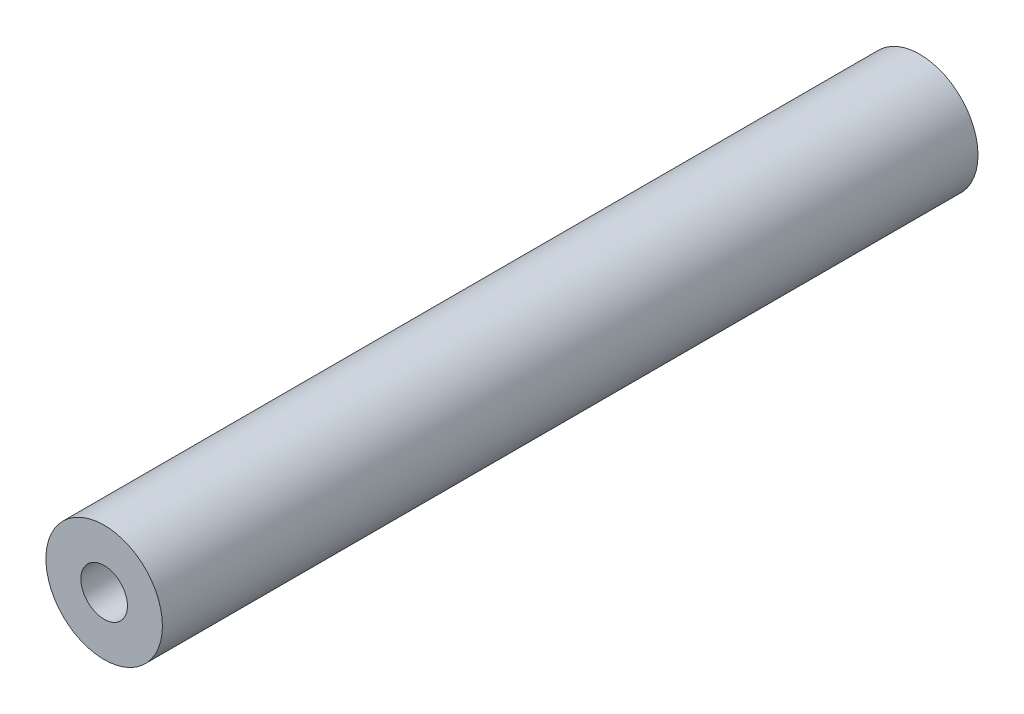
ISO-10303-21;
HEADER;
FILE_DESCRIPTION(('STEP AP214'),'2;1');
FILE_NAME('part.step','',(''),(''),'','','');
FILE_SCHEMA(('AUTOMOTIVE_DESIGN { 1 0 10303 214 1 1 1 1 }'));
ENDSEC;
DATA;
#1=APPLICATION_CONTEXT('core data for automotive mechanical design processes');
#2=APPLICATION_PROTOCOL_DEFINITION('international standard','automotive_design',2000,#1);
#3=PRODUCT_CONTEXT('',#1,'mechanical');
#4=PRODUCT('Part','Part','',(#3));
#5=PRODUCT_RELATED_PRODUCT_CATEGORY('part','',(#4));
#6=PRODUCT_DEFINITION_FORMATION('','',#4);
#7=PRODUCT_DEFINITION_CONTEXT('part definition',#1,'design');
#8=PRODUCT_DEFINITION('design','',#6,#7);
#9=PRODUCT_DEFINITION_SHAPE('','',#8);
#10=(LENGTH_UNIT() NAMED_UNIT(*) SI_UNIT(.MILLI.,.METRE.));
#11=(NAMED_UNIT(*) PLANE_ANGLE_UNIT() SI_UNIT($,.RADIAN.));
#12=(NAMED_UNIT(*) SI_UNIT($,.STERADIAN.) SOLID_ANGLE_UNIT());
#13=UNCERTAINTY_MEASURE_WITH_UNIT(LENGTH_MEASURE(1.E-05),#10,'distance_accuracy_value','');
#14=(GEOMETRIC_REPRESENTATION_CONTEXT(3) GLOBAL_UNCERTAINTY_ASSIGNED_CONTEXT((#13)) GLOBAL_UNIT_ASSIGNED_CONTEXT((#10,
#11,#12)) REPRESENTATION_CONTEXT('',''));
#15=CARTESIAN_POINT('',(0.,0.,0.));
#16=DIRECTION('',(0.,0.,1.));
#17=DIRECTION('',(1.,0.,0.));
#18=AXIS2_PLACEMENT_3D('',#15,#16,#17);
#19=CARTESIAN_POINT('',(0.,0.,70.));
#20=DIRECTION('',(0.,0.,1.));
#21=DIRECTION('',(1.,0.,0.));
#22=AXIS2_PLACEMENT_3D('',#19,#20,#21);
#23=PLANE('',#22);
#24=CARTESIAN_POINT('',(0.,0.,70.));
#25=DIRECTION('',(0.,0.,1.));
#26=DIRECTION('',(1.,0.,0.));
#27=AXIS2_PLACEMENT_3D('',#24,#25,#26);
#28=CIRCLE('',#27,5.);
#29=CARTESIAN_POINT('',(5.,0.,70.));
#30=VERTEX_POINT('',#29);
#31=EDGE_CURVE('E10',#30,#30,#28,.T.);
#32=ORIENTED_EDGE('',*,*,#31,.T.);
#33=EDGE_LOOP('',(#32));
#34=FACE_BOUND('',#33,.T.);
#35=CARTESIAN_POINT('',(0.,0.,70.));
#36=DIRECTION('',(0.,0.,1.));
#37=DIRECTION('',(1.,0.,0.));
#38=AXIS2_PLACEMENT_3D('',#35,#36,#37);
#39=CIRCLE('',#38,2.);
#40=CARTESIAN_POINT('',(2.,0.,70.));
#41=VERTEX_POINT('',#40);
#42=EDGE_CURVE('E41',#41,#41,#39,.T.);
#43=ORIENTED_EDGE('',*,*,#42,.F.);
#44=EDGE_LOOP('',(#43));
#45=FACE_BOUND('',#44,.T.);
#46=ADVANCED_FACE('F30',(#34,#45),#23,.T.);
#47=CARTESIAN_POINT('',(0.,0.,0.));
#48=DIRECTION('',(0.,0.,1.));
#49=DIRECTION('',(1.,0.,0.));
#50=AXIS2_PLACEMENT_3D('',#47,#48,#49);
#51=PLANE('',#50);
#52=CARTESIAN_POINT('',(0.,0.,0.));
#53=DIRECTION('',(0.,0.,1.));
#54=DIRECTION('',(1.,0.,0.));
#55=AXIS2_PLACEMENT_3D('',#52,#53,#54);
#56=CIRCLE('',#55,5.);
#57=CARTESIAN_POINT('',(5.,0.,0.));
#58=VERTEX_POINT('',#57);
#59=EDGE_CURVE('E34',#58,#58,#56,.T.);
#60=ORIENTED_EDGE('',*,*,#59,.F.);
#61=EDGE_LOOP('',(#60));
#62=FACE_BOUND('',#61,.T.);
#63=CARTESIAN_POINT('',(0.,0.,0.));
#64=DIRECTION('',(0.,0.,1.));
#65=DIRECTION('',(1.,0.,0.));
#66=AXIS2_PLACEMENT_3D('',#63,#64,#65);
#67=CIRCLE('',#66,2.);
#68=CARTESIAN_POINT('',(2.,0.,0.));
#69=VERTEX_POINT('',#68);
#70=EDGE_CURVE('E43',#69,#69,#67,.T.);
#71=ORIENTED_EDGE('',*,*,#70,.T.);
#72=EDGE_LOOP('',(#71));
#73=FACE_BOUND('',#72,.T.);
#74=ADVANCED_FACE('F53',(#62,#73),#51,.F.);
#75=CARTESIAN_POINT('',(0.,0.,70.));
#76=DIRECTION('',(0.,0.,-1.));
#77=DIRECTION('',(-1.,0.,0.));
#78=AXIS2_PLACEMENT_3D('',#75,#76,#77);
#79=CYLINDRICAL_SURFACE('',#78,5.);
#80=ORIENTED_EDGE('',*,*,#31,.F.);
#81=EDGE_LOOP('',(#80));
#82=FACE_BOUND('',#81,.T.);
#83=ORIENTED_EDGE('',*,*,#59,.T.);
#84=EDGE_LOOP('',(#83));
#85=FACE_BOUND('',#84,.T.);
#86=ADVANCED_FACE('F32',(#82,#85),#79,.T.);
#87=CARTESIAN_POINT('',(0.,0.,70.));
#88=DIRECTION('',(0.,0.,-1.));
#89=DIRECTION('',(-1.,0.,0.));
#90=AXIS2_PLACEMENT_3D('',#87,#88,#89);
#91=CYLINDRICAL_SURFACE('',#90,2.);
#92=ORIENTED_EDGE('',*,*,#42,.T.);
#93=EDGE_LOOP('',(#92));
#94=FACE_BOUND('',#93,.T.);
#95=ORIENTED_EDGE('',*,*,#70,.F.);
#96=EDGE_LOOP('',(#95));
#97=FACE_BOUND('',#96,.T.);
#98=ADVANCED_FACE('F49',(#94,#97),#91,.F.);
#99=CLOSED_SHELL('',(#46,#74,#86,#98));
#100=MANIFOLD_SOLID_BREP('B2',#99);
#101=ADVANCED_BREP_SHAPE_REPRESENTATION('',(#18,#100),#14);
#102=SHAPE_DEFINITION_REPRESENTATION(#9,#101);
ENDSEC;
END-ISO-10303-21;
